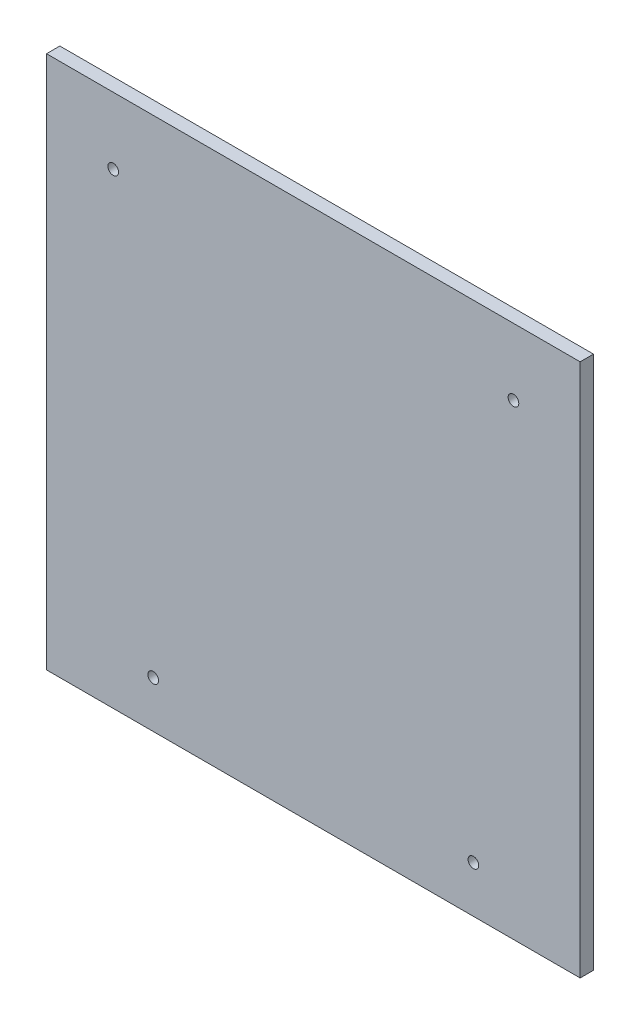
ISO-10303-21;
HEADER;
FILE_DESCRIPTION(('STEP AP214'),'2;1');
FILE_NAME('part.step','',(''),(''),'','','');
FILE_SCHEMA(('AUTOMOTIVE_DESIGN { 1 0 10303 214 1 1 1 1 }'));
ENDSEC;
DATA;
#1=APPLICATION_CONTEXT('core data for automotive mechanical design processes');
#2=APPLICATION_PROTOCOL_DEFINITION('international standard','automotive_design',2000,#1);
#3=PRODUCT_CONTEXT('',#1,'mechanical');
#4=PRODUCT('Part','Part','',(#3));
#5=PRODUCT_RELATED_PRODUCT_CATEGORY('part','',(#4));
#6=PRODUCT_DEFINITION_FORMATION('','',#4);
#7=PRODUCT_DEFINITION_CONTEXT('part definition',#1,'design');
#8=PRODUCT_DEFINITION('design','',#6,#7);
#9=PRODUCT_DEFINITION_SHAPE('','',#8);
#10=(LENGTH_UNIT() NAMED_UNIT(*) SI_UNIT(.MILLI.,.METRE.));
#11=(NAMED_UNIT(*) PLANE_ANGLE_UNIT() SI_UNIT($,.RADIAN.));
#12=(NAMED_UNIT(*) SI_UNIT($,.STERADIAN.) SOLID_ANGLE_UNIT());
#13=UNCERTAINTY_MEASURE_WITH_UNIT(LENGTH_MEASURE(1.E-05),#10,'distance_accuracy_value','');
#14=(GEOMETRIC_REPRESENTATION_CONTEXT(3) GLOBAL_UNCERTAINTY_ASSIGNED_CONTEXT((#13)) GLOBAL_UNIT_ASSIGNED_CONTEXT((#10,
#11,#12)) REPRESENTATION_CONTEXT('',''));
#15=CARTESIAN_POINT('',(0.,0.,0.));
#16=DIRECTION('',(0.,0.,1.));
#17=DIRECTION('',(1.,0.,0.));
#18=AXIS2_PLACEMENT_3D('',#15,#16,#17);
#19=CARTESIAN_POINT('',(0.,0.,5.));
#20=DIRECTION('',(0.,0.,1.));
#21=DIRECTION('',(1.,0.,0.));
#22=AXIS2_PLACEMENT_3D('',#19,#20,#21);
#23=PLANE('',#22);
#24=CARTESIAN_POINT('',(59.9999999999999,-82.5,5.));
#25=DIRECTION('',(0.,0.,1.));
#26=DIRECTION('',(-1.,0.,0.));
#27=AXIS2_PLACEMENT_3D('',#24,#25,#26);
#28=CIRCLE('',#27,2.);
#29=CARTESIAN_POINT('',(57.9999999999999,-82.5,5.));
#30=VERTEX_POINT('',#29);
#31=EDGE_CURVE('E123',#30,#30,#28,.T.);
#32=ORIENTED_EDGE('',*,*,#31,.F.);
#33=EDGE_LOOP('',(#32));
#34=FACE_BOUND('',#33,.T.);
#35=CARTESIAN_POINT('',(-60.,-82.5,5.));
#36=DIRECTION('',(0.,0.,1.));
#37=DIRECTION('',(1.,0.,0.));
#38=AXIS2_PLACEMENT_3D('',#35,#36,#37);
#39=CIRCLE('',#38,2.);
#40=CARTESIAN_POINT('',(-58.,-82.5,5.));
#41=VERTEX_POINT('',#40);
#42=EDGE_CURVE('E102',#41,#41,#39,.T.);
#43=ORIENTED_EDGE('',*,*,#42,.F.);
#44=EDGE_LOOP('',(#43));
#45=FACE_BOUND('',#44,.T.);
#46=DIRECTION('',(0.,1.,0.));
#47=VECTOR('',#46,1.);
#48=CARTESIAN_POINT('',(100.,100.,5.));
#49=LINE('',#48,#47);
#50=CARTESIAN_POINT('',(100.,-100.,5.));
#51=VERTEX_POINT('',#50);
#52=CARTESIAN_POINT('',(100.,100.,5.));
#53=VERTEX_POINT('',#52);
#54=EDGE_CURVE('E87',#51,#53,#49,.T.);
#55=ORIENTED_EDGE('',*,*,#54,.T.);
#56=DIRECTION('',(-1.,0.,0.));
#57=VECTOR('',#56,1.);
#58=CARTESIAN_POINT('',(-100.,100.,5.));
#59=LINE('',#58,#57);
#60=CARTESIAN_POINT('',(-100.,100.,5.));
#61=VERTEX_POINT('',#60);
#62=EDGE_CURVE('E82',#53,#61,#59,.T.);
#63=ORIENTED_EDGE('',*,*,#62,.T.);
#64=DIRECTION('',(0.,-1.,0.));
#65=VECTOR('',#64,1.);
#66=CARTESIAN_POINT('',(-100.,100.,5.));
#67=LINE('',#66,#65);
#68=CARTESIAN_POINT('',(-100.,-100.,5.));
#69=VERTEX_POINT('',#68);
#70=EDGE_CURVE('E85',#61,#69,#67,.T.);
#71=ORIENTED_EDGE('',*,*,#70,.T.);
#72=DIRECTION('',(1.,0.,0.));
#73=VECTOR('',#72,1.);
#74=CARTESIAN_POINT('',(-100.,-100.,5.));
#75=LINE('',#74,#73);
#76=EDGE_CURVE('E52',#69,#51,#75,.T.);
#77=ORIENTED_EDGE('',*,*,#76,.T.);
#78=EDGE_LOOP('',(#55,#63,#71,#77));
#79=FACE_BOUND('',#78,.T.);
#80=CARTESIAN_POINT('',(-75.,75.,5.));
#81=DIRECTION('',(0.,0.,1.));
#82=DIRECTION('',(1.,0.,0.));
#83=AXIS2_PLACEMENT_3D('',#80,#81,#82);
#84=CIRCLE('',#83,2.);
#85=CARTESIAN_POINT('',(-73.,75.,5.));
#86=VERTEX_POINT('',#85);
#87=EDGE_CURVE('E117',#86,#86,#84,.T.);
#88=ORIENTED_EDGE('',*,*,#87,.F.);
#89=EDGE_LOOP('',(#88));
#90=FACE_BOUND('',#89,.T.);
#91=CARTESIAN_POINT('',(74.9999999999999,75.,5.));
#92=DIRECTION('',(0.,0.,1.));
#93=DIRECTION('',(-1.,0.,0.));
#94=AXIS2_PLACEMENT_3D('',#91,#92,#93);
#95=CIRCLE('',#94,2.);
#96=CARTESIAN_POINT('',(72.9999999999999,75.,5.));
#97=VERTEX_POINT('',#96);
#98=EDGE_CURVE('E129',#97,#97,#95,.T.);
#99=ORIENTED_EDGE('',*,*,#98,.F.);
#100=EDGE_LOOP('',(#99));
#101=FACE_BOUND('',#100,.T.);
#102=ADVANCED_FACE('F35',(#34,#45,#79,#90,#101),#23,.T.);
#103=CARTESIAN_POINT('',(0.,0.,0.));
#104=DIRECTION('',(0.,0.,1.));
#105=DIRECTION('',(1.,0.,0.));
#106=AXIS2_PLACEMENT_3D('',#103,#104,#105);
#107=PLANE('',#106);
#108=DIRECTION('',(0.,1.,0.));
#109=VECTOR('',#108,1.);
#110=CARTESIAN_POINT('',(100.,100.,0.));
#111=LINE('',#110,#109);
#112=CARTESIAN_POINT('',(100.,-100.,0.));
#113=VERTEX_POINT('',#112);
#114=CARTESIAN_POINT('',(100.,100.,0.));
#115=VERTEX_POINT('',#114);
#116=EDGE_CURVE('E99',#113,#115,#111,.T.);
#117=ORIENTED_EDGE('',*,*,#116,.F.);
#118=DIRECTION('',(1.,0.,0.));
#119=VECTOR('',#118,1.);
#120=CARTESIAN_POINT('',(-100.,-100.,0.));
#121=LINE('',#120,#119);
#122=CARTESIAN_POINT('',(-100.,-100.,0.));
#123=VERTEX_POINT('',#122);
#124=EDGE_CURVE('E75',#123,#113,#121,.T.);
#125=ORIENTED_EDGE('',*,*,#124,.F.);
#126=DIRECTION('',(0.,-1.,0.));
#127=VECTOR('',#126,1.);
#128=CARTESIAN_POINT('',(-100.,100.,0.));
#129=LINE('',#128,#127);
#130=CARTESIAN_POINT('',(-100.,100.,0.));
#131=VERTEX_POINT('',#130);
#132=EDGE_CURVE('E69',#131,#123,#129,.T.);
#133=ORIENTED_EDGE('',*,*,#132,.F.);
#134=DIRECTION('',(-1.,0.,0.));
#135=VECTOR('',#134,1.);
#136=CARTESIAN_POINT('',(-100.,100.,0.));
#137=LINE('',#136,#135);
#138=EDGE_CURVE('E91',#115,#131,#137,.T.);
#139=ORIENTED_EDGE('',*,*,#138,.F.);
#140=EDGE_LOOP('',(#117,#125,#133,#139));
#141=FACE_BOUND('',#140,.T.);
#142=CARTESIAN_POINT('',(-60.,-82.5,0.));
#143=DIRECTION('',(0.,0.,1.));
#144=DIRECTION('',(1.,0.,0.));
#145=AXIS2_PLACEMENT_3D('',#142,#143,#144);
#146=CIRCLE('',#145,2.);
#147=CARTESIAN_POINT('',(-58.,-82.5,0.));
#148=VERTEX_POINT('',#147);
#149=EDGE_CURVE('E114',#148,#148,#146,.T.);
#150=ORIENTED_EDGE('',*,*,#149,.T.);
#151=EDGE_LOOP('',(#150));
#152=FACE_BOUND('',#151,.T.);
#153=CARTESIAN_POINT('',(-75.,75.,0.));
#154=DIRECTION('',(0.,0.,1.));
#155=DIRECTION('',(1.,0.,0.));
#156=AXIS2_PLACEMENT_3D('',#153,#154,#155);
#157=CIRCLE('',#156,2.);
#158=CARTESIAN_POINT('',(-73.,75.,0.));
#159=VERTEX_POINT('',#158);
#160=EDGE_CURVE('E120',#159,#159,#157,.T.);
#161=ORIENTED_EDGE('',*,*,#160,.T.);
#162=EDGE_LOOP('',(#161));
#163=FACE_BOUND('',#162,.T.);
#164=CARTESIAN_POINT('',(59.9999999999999,-82.5,0.));
#165=DIRECTION('',(0.,0.,1.));
#166=DIRECTION('',(-1.,0.,0.));
#167=AXIS2_PLACEMENT_3D('',#164,#165,#166);
#168=CIRCLE('',#167,2.);
#169=CARTESIAN_POINT('',(57.9999999999999,-82.5,0.));
#170=VERTEX_POINT('',#169);
#171=EDGE_CURVE('E126',#170,#170,#168,.T.);
#172=ORIENTED_EDGE('',*,*,#171,.T.);
#173=EDGE_LOOP('',(#172));
#174=FACE_BOUND('',#173,.T.);
#175=CARTESIAN_POINT('',(74.9999999999999,75.,0.));
#176=DIRECTION('',(0.,0.,1.));
#177=DIRECTION('',(-1.,0.,0.));
#178=AXIS2_PLACEMENT_3D('',#175,#176,#177);
#179=CIRCLE('',#178,2.);
#180=CARTESIAN_POINT('',(72.9999999999999,75.,0.));
#181=VERTEX_POINT('',#180);
#182=EDGE_CURVE('E132',#181,#181,#179,.T.);
#183=ORIENTED_EDGE('',*,*,#182,.T.);
#184=EDGE_LOOP('',(#183));
#185=FACE_BOUND('',#184,.T.);
#186=ADVANCED_FACE('F110',(#141,#152,#163,#174,#185),#107,.F.);
#187=CARTESIAN_POINT('',(100.,100.,5.));
#188=DIRECTION('',(-1.,0.,0.));
#189=DIRECTION('',(0.,-1.,0.));
#190=AXIS2_PLACEMENT_3D('',#187,#188,#189);
#191=PLANE('',#190);
#192=ORIENTED_EDGE('',*,*,#116,.T.);
#193=DIRECTION('',(0.,0.,-1.));
#194=VECTOR('',#193,1.);
#195=CARTESIAN_POINT('',(100.,100.,5.));
#196=LINE('',#195,#194);
#197=EDGE_CURVE('E11',#53,#115,#196,.T.);
#198=ORIENTED_EDGE('',*,*,#197,.F.);
#199=ORIENTED_EDGE('',*,*,#54,.F.);
#200=DIRECTION('',(0.,0.,-1.));
#201=VECTOR('',#200,1.);
#202=CARTESIAN_POINT('',(100.,-100.,5.));
#203=LINE('',#202,#201);
#204=EDGE_CURVE('E95',#51,#113,#203,.T.);
#205=ORIENTED_EDGE('',*,*,#204,.T.);
#206=EDGE_LOOP('',(#192,#198,#199,#205));
#207=FACE_BOUND('',#206,.T.);
#208=ADVANCED_FACE('F37',(#207),#191,.F.);
#209=CARTESIAN_POINT('',(-100.,100.,5.));
#210=DIRECTION('',(0.,-1.,0.));
#211=DIRECTION('',(0.,0.,-1.));
#212=AXIS2_PLACEMENT_3D('',#209,#210,#211);
#213=PLANE('',#212);
#214=ORIENTED_EDGE('',*,*,#138,.T.);
#215=DIRECTION('',(0.,0.,-1.));
#216=VECTOR('',#215,1.);
#217=CARTESIAN_POINT('',(-100.,100.,5.));
#218=LINE('',#217,#216);
#219=EDGE_CURVE('E44',#61,#131,#218,.T.);
#220=ORIENTED_EDGE('',*,*,#219,.F.);
#221=ORIENTED_EDGE('',*,*,#62,.F.);
#222=ORIENTED_EDGE('',*,*,#197,.T.);
#223=EDGE_LOOP('',(#214,#220,#221,#222));
#224=FACE_BOUND('',#223,.T.);
#225=ADVANCED_FACE('F90',(#224),#213,.F.);
#226=CARTESIAN_POINT('',(-100.,100.,5.));
#227=DIRECTION('',(1.,0.,0.));
#228=DIRECTION('',(0.,1.,0.));
#229=AXIS2_PLACEMENT_3D('',#226,#227,#228);
#230=PLANE('',#229);
#231=ORIENTED_EDGE('',*,*,#132,.T.);
#232=DIRECTION('',(0.,0.,-1.));
#233=VECTOR('',#232,1.);
#234=CARTESIAN_POINT('',(-100.,-100.,5.));
#235=LINE('',#234,#233);
#236=EDGE_CURVE('E92',#69,#123,#235,.T.);
#237=ORIENTED_EDGE('',*,*,#236,.F.);
#238=ORIENTED_EDGE('',*,*,#70,.F.);
#239=ORIENTED_EDGE('',*,*,#219,.T.);
#240=EDGE_LOOP('',(#231,#237,#238,#239));
#241=FACE_BOUND('',#240,.T.);
#242=ADVANCED_FACE('F93',(#241),#230,.F.);
#243=CARTESIAN_POINT('',(-100.,-100.,5.));
#244=DIRECTION('',(0.,1.,0.));
#245=DIRECTION('',(0.,0.,1.));
#246=AXIS2_PLACEMENT_3D('',#243,#244,#245);
#247=PLANE('',#246);
#248=ORIENTED_EDGE('',*,*,#124,.T.);
#249=ORIENTED_EDGE('',*,*,#204,.F.);
#250=ORIENTED_EDGE('',*,*,#76,.F.);
#251=ORIENTED_EDGE('',*,*,#236,.T.);
#252=EDGE_LOOP('',(#248,#249,#250,#251));
#253=FACE_BOUND('',#252,.T.);
#254=ADVANCED_FACE('F107',(#253),#247,.F.);
#255=CARTESIAN_POINT('',(-60.,-82.5,5.));
#256=DIRECTION('',(0.,0.,-1.));
#257=DIRECTION('',(-1.,0.,0.));
#258=AXIS2_PLACEMENT_3D('',#255,#256,#257);
#259=CYLINDRICAL_SURFACE('',#258,2.);
#260=ORIENTED_EDGE('',*,*,#42,.T.);
#261=EDGE_LOOP('',(#260));
#262=FACE_BOUND('',#261,.T.);
#263=ORIENTED_EDGE('',*,*,#149,.F.);
#264=EDGE_LOOP('',(#263));
#265=FACE_BOUND('',#264,.T.);
#266=ADVANCED_FACE('F151',(#262,#265),#259,.F.);
#267=CARTESIAN_POINT('',(-75.,75.,5.));
#268=DIRECTION('',(0.,0.,-1.));
#269=DIRECTION('',(-1.,0.,0.));
#270=AXIS2_PLACEMENT_3D('',#267,#268,#269);
#271=CYLINDRICAL_SURFACE('',#270,2.);
#272=ORIENTED_EDGE('',*,*,#87,.T.);
#273=EDGE_LOOP('',(#272));
#274=FACE_BOUND('',#273,.T.);
#275=ORIENTED_EDGE('',*,*,#160,.F.);
#276=EDGE_LOOP('',(#275));
#277=FACE_BOUND('',#276,.T.);
#278=ADVANCED_FACE('F207',(#274,#277),#271,.F.);
#279=CARTESIAN_POINT('',(59.9999999999999,-82.5,5.));
#280=DIRECTION('',(0.,0.,-1.));
#281=DIRECTION('',(-1.,0.,0.));
#282=AXIS2_PLACEMENT_3D('',#279,#280,#281);
#283=CYLINDRICAL_SURFACE('',#282,2.);
#284=ORIENTED_EDGE('',*,*,#31,.T.);
#285=EDGE_LOOP('',(#284));
#286=FACE_BOUND('',#285,.T.);
#287=ORIENTED_EDGE('',*,*,#171,.F.);
#288=EDGE_LOOP('',(#287));
#289=FACE_BOUND('',#288,.T.);
#290=ADVANCED_FACE('F215',(#286,#289),#283,.F.);
#291=CARTESIAN_POINT('',(74.9999999999999,75.,5.));
#292=DIRECTION('',(0.,0.,-1.));
#293=DIRECTION('',(-1.,0.,0.));
#294=AXIS2_PLACEMENT_3D('',#291,#292,#293);
#295=CYLINDRICAL_SURFACE('',#294,2.);
#296=ORIENTED_EDGE('',*,*,#98,.T.);
#297=EDGE_LOOP('',(#296));
#298=FACE_BOUND('',#297,.T.);
#299=ORIENTED_EDGE('',*,*,#182,.F.);
#300=EDGE_LOOP('',(#299));
#301=FACE_BOUND('',#300,.T.);
#302=ADVANCED_FACE('F138',(#298,#301),#295,.F.);
#303=CLOSED_SHELL('',(#102,#186,#208,#225,#242,#254,#266,#278,#290,#302));
#304=MANIFOLD_SOLID_BREP('B2',#303);
#305=ADVANCED_BREP_SHAPE_REPRESENTATION('',(#18,#304),#14);
#306=SHAPE_DEFINITION_REPRESENTATION(#9,#305);
ENDSEC;
END-ISO-10303-21;
